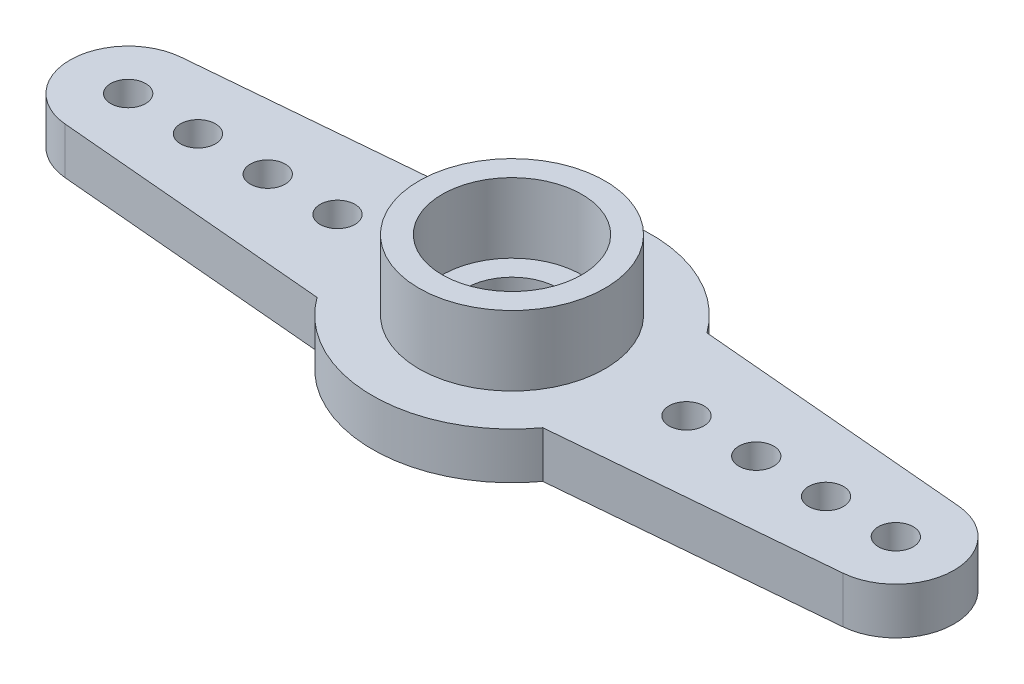
ISO-10303-21;
HEADER;
FILE_DESCRIPTION(('STEP AP214'),'2;1');
FILE_NAME('part.step','',(''),(''),'','','');
FILE_SCHEMA(('AUTOMOTIVE_DESIGN { 1 0 10303 214 1 1 1 1 }'));
ENDSEC;
DATA;
#1=APPLICATION_CONTEXT('core data for automotive mechanical design processes');
#2=APPLICATION_PROTOCOL_DEFINITION('international standard','automotive_design',2000,#1);
#3=PRODUCT_CONTEXT('',#1,'mechanical');
#4=PRODUCT('Part','Part','',(#3));
#5=PRODUCT_RELATED_PRODUCT_CATEGORY('part','',(#4));
#6=PRODUCT_DEFINITION_FORMATION('','',#4);
#7=PRODUCT_DEFINITION_CONTEXT('part definition',#1,'design');
#8=PRODUCT_DEFINITION('design','',#6,#7);
#9=PRODUCT_DEFINITION_SHAPE('','',#8);
#10=(LENGTH_UNIT() NAMED_UNIT(*) SI_UNIT(.MILLI.,.METRE.));
#11=(NAMED_UNIT(*) PLANE_ANGLE_UNIT() SI_UNIT($,.RADIAN.));
#12=(NAMED_UNIT(*) SI_UNIT($,.STERADIAN.) SOLID_ANGLE_UNIT());
#13=UNCERTAINTY_MEASURE_WITH_UNIT(LENGTH_MEASURE(1.E-05),#10,'distance_accuracy_value','');
#14=(GEOMETRIC_REPRESENTATION_CONTEXT(3) GLOBAL_UNCERTAINTY_ASSIGNED_CONTEXT((#13)) GLOBAL_UNIT_ASSIGNED_CONTEXT((#10,
#11,#12)) REPRESENTATION_CONTEXT('',''));
#15=CARTESIAN_POINT('',(0.,0.,0.));
#16=DIRECTION('',(0.,0.,1.));
#17=DIRECTION('',(1.,0.,0.));
#18=AXIS2_PLACEMENT_3D('',#15,#16,#17);
#19=CARTESIAN_POINT('',(16.5,2.,0.));
#20=DIRECTION('',(0.,1.,0.));
#21=DIRECTION('',(0.,0.,1.));
#22=AXIS2_PLACEMENT_3D('',#19,#20,#21);
#23=PLANE('',#22);
#24=CARTESIAN_POINT('',(0.,2.,0.));
#25=DIRECTION('',(0.,1.,0.));
#26=DIRECTION('',(0.,0.,1.));
#27=AXIS2_PLACEMENT_3D('',#24,#25,#26);
#28=CIRCLE('',#27,2.);
#29=CARTESIAN_POINT('',(0.,2.,2.));
#30=VERTEX_POINT('',#29);
#31=EDGE_CURVE('E147',#30,#30,#28,.T.);
#32=ORIENTED_EDGE('',*,*,#31,.F.);
#33=EDGE_LOOP('',(#32));
#34=FACE_BOUND('',#33,.T.);
#35=CARTESIAN_POINT('',(0.,2.,0.));
#36=DIRECTION('',(0.,1.,0.));
#37=DIRECTION('',(0.,0.,1.));
#38=AXIS2_PLACEMENT_3D('',#35,#36,#37);
#39=CIRCLE('',#38,3.);
#40=CARTESIAN_POINT('',(0.,2.,3.));
#41=VERTEX_POINT('',#40);
#42=EDGE_CURVE('E11',#41,#41,#39,.F.);
#43=ORIENTED_EDGE('',*,*,#42,.F.);
#44=EDGE_LOOP('',(#43));
#45=FACE_BOUND('',#44,.T.);
#46=ADVANCED_FACE('F38',(#34,#45),#23,.T.);
#47=CARTESIAN_POINT('',(0.,2.,0.));
#48=DIRECTION('',(0.,1.,0.));
#49=DIRECTION('',(0.,0.,1.));
#50=AXIS2_PLACEMENT_3D('',#47,#48,#49);
#51=CIRCLE('',#50,4.);
#52=CARTESIAN_POINT('',(0.,2.,4.));
#53=VERTEX_POINT('',#52);
#54=EDGE_CURVE('E287',#53,#53,#51,.T.);
#55=ORIENTED_EDGE('',*,*,#54,.F.);
#56=EDGE_LOOP('',(#55));
#57=FACE_BOUND('',#56,.T.);
#58=CARTESIAN_POINT('',(-10.5,2.,0.));
#59=DIRECTION('',(0.,1.,0.));
#60=DIRECTION('',(0.,0.,-1.));
#61=AXIS2_PLACEMENT_3D('',#58,#59,#60);
#62=CIRCLE('',#61,0.75);
#63=CARTESIAN_POINT('',(-10.5,2.,-0.75));
#64=VERTEX_POINT('',#63);
#65=EDGE_CURVE('E267',#64,#64,#62,.T.);
#66=ORIENTED_EDGE('',*,*,#65,.F.);
#67=EDGE_LOOP('',(#66));
#68=FACE_BOUND('',#67,.T.);
#69=CARTESIAN_POINT('',(-16.5,2.,0.));
#70=DIRECTION('',(0.,1.,0.));
#71=DIRECTION('',(0.,0.,-1.));
#72=AXIS2_PLACEMENT_3D('',#69,#70,#71);
#73=CIRCLE('',#72,0.750000000000002);
#74=CARTESIAN_POINT('',(-16.5,2.,-0.750000000000002));
#75=VERTEX_POINT('',#74);
#76=EDGE_CURVE('E251',#75,#75,#73,.T.);
#77=ORIENTED_EDGE('',*,*,#76,.F.);
#78=EDGE_LOOP('',(#77));
#79=FACE_BOUND('',#78,.T.);
#80=CARTESIAN_POINT('',(13.5,2.,0.));
#81=DIRECTION('',(0.,1.,0.));
#82=DIRECTION('',(0.,0.,1.));
#83=AXIS2_PLACEMENT_3D('',#80,#81,#82);
#84=CIRCLE('',#83,0.750000000000002);
#85=CARTESIAN_POINT('',(13.5,2.,0.750000000000002));
#86=VERTEX_POINT('',#85);
#87=EDGE_CURVE('E235',#86,#86,#84,.T.);
#88=ORIENTED_EDGE('',*,*,#87,.F.);
#89=EDGE_LOOP('',(#88));
#90=FACE_BOUND('',#89,.T.);
#91=CARTESIAN_POINT('',(7.5,2.,0.));
#92=DIRECTION('',(0.,1.,0.));
#93=DIRECTION('',(0.,0.,1.));
#94=AXIS2_PLACEMENT_3D('',#91,#92,#93);
#95=CIRCLE('',#94,0.75);
#96=CARTESIAN_POINT('',(7.5,2.,0.75));
#97=VERTEX_POINT('',#96);
#98=EDGE_CURVE('E219',#97,#97,#95,.T.);
#99=ORIENTED_EDGE('',*,*,#98,.F.);
#100=EDGE_LOOP('',(#99));
#101=FACE_BOUND('',#100,.T.);
#102=CARTESIAN_POINT('',(16.5,2.,0.));
#103=DIRECTION('',(0.,1.,0.));
#104=DIRECTION('',(0.,0.,1.));
#105=AXIS2_PLACEMENT_3D('',#102,#103,#104);
#106=CIRCLE('',#105,2.5);
#107=CARTESIAN_POINT('',(16.7178893568691,2.,2.49048674522937));
#108=VERTEX_POINT('',#107);
#109=CARTESIAN_POINT('',(16.7178893568691,2.,-2.49048674522936));
#110=VERTEX_POINT('',#109);
#111=EDGE_CURVE('E165',#108,#110,#106,.T.);
#112=ORIENTED_EDGE('',*,*,#111,.T.);
#113=DIRECTION('',(-0.996194698091746,0.,-0.0871557427476513));
#114=VECTOR('',#113,1.);
#115=CARTESIAN_POINT('',(16.7178893568691,2.,-2.49048674522936));
#116=LINE('',#115,#114);
#117=CARTESIAN_POINT('',(4.85276526325977,2.,-3.5285505947484));
#118=VERTEX_POINT('',#117);
#119=EDGE_CURVE('E100',#110,#118,#116,.T.);
#120=ORIENTED_EDGE('',*,*,#119,.T.);
#121=CARTESIAN_POINT('',(0.,2.,0.));
#122=DIRECTION('',(0.,1.,0.));
#123=DIRECTION('',(0.,0.,1.));
#124=AXIS2_PLACEMENT_3D('',#121,#122,#123);
#125=CIRCLE('',#124,6.);
#126=CARTESIAN_POINT('',(-4.85276526325977,2.,-3.5285505947484));
#127=VERTEX_POINT('',#126);
#128=EDGE_CURVE('E205',#118,#127,#125,.T.);
#129=ORIENTED_EDGE('',*,*,#128,.T.);
#130=DIRECTION('',(-0.996194698091746,0.,0.0871557427476513));
#131=VECTOR('',#130,1.);
#132=CARTESIAN_POINT('',(-16.7178893568691,2.,-2.49048674522936));
#133=LINE('',#132,#131);
#134=CARTESIAN_POINT('',(-16.7178893568691,2.,-2.49048674522936));
#135=VERTEX_POINT('',#134);
#136=EDGE_CURVE('E203',#127,#135,#133,.T.);
#137=ORIENTED_EDGE('',*,*,#136,.T.);
#138=CARTESIAN_POINT('',(-16.5,2.,0.));
#139=DIRECTION('',(0.,1.,0.));
#140=DIRECTION('',(0.,0.,-1.));
#141=AXIS2_PLACEMENT_3D('',#138,#139,#140);
#142=CIRCLE('',#141,2.5);
#143=CARTESIAN_POINT('',(-16.7178893568691,2.,2.49048674522937));
#144=VERTEX_POINT('',#143);
#145=EDGE_CURVE('E120',#135,#144,#142,.T.);
#146=ORIENTED_EDGE('',*,*,#145,.T.);
#147=DIRECTION('',(0.996194698091746,0.,0.0871557427476516));
#148=VECTOR('',#147,1.);
#149=CARTESIAN_POINT('',(-16.7178893568691,2.,2.49048674522937));
#150=LINE('',#149,#148);
#151=CARTESIAN_POINT('',(-4.85276526325977,2.,3.52855059474841));
#152=VERTEX_POINT('',#151);
#153=EDGE_CURVE('E113',#144,#152,#150,.T.);
#154=ORIENTED_EDGE('',*,*,#153,.T.);
#155=CARTESIAN_POINT('',(0.,2.,0.));
#156=DIRECTION('',(0.,1.,0.));
#157=DIRECTION('',(0.,0.,1.));
#158=AXIS2_PLACEMENT_3D('',#155,#156,#157);
#159=CIRCLE('',#158,6.);
#160=CARTESIAN_POINT('',(4.85276526325977,2.,3.52855059474841));
#161=VERTEX_POINT('',#160);
#162=EDGE_CURVE('E118',#152,#161,#159,.T.);
#163=ORIENTED_EDGE('',*,*,#162,.T.);
#164=DIRECTION('',(0.996194698091746,0.,-0.0871557427476516));
#165=VECTOR('',#164,1.);
#166=CARTESIAN_POINT('',(16.7178893568691,2.,2.49048674522937));
#167=LINE('',#166,#165);
#168=EDGE_CURVE('E56',#161,#108,#167,.T.);
#169=ORIENTED_EDGE('',*,*,#168,.T.);
#170=EDGE_LOOP('',(#112,#120,#129,#137,#146,#154,#163,#169));
#171=FACE_BOUND('',#170,.T.);
#172=CARTESIAN_POINT('',(10.5,2.,0.));
#173=DIRECTION('',(0.,1.,0.));
#174=DIRECTION('',(0.,0.,1.));
#175=AXIS2_PLACEMENT_3D('',#172,#173,#174);
#176=CIRCLE('',#175,0.75);
#177=CARTESIAN_POINT('',(10.5,2.,0.75));
#178=VERTEX_POINT('',#177);
#179=EDGE_CURVE('E227',#178,#178,#176,.T.);
#180=ORIENTED_EDGE('',*,*,#179,.F.);
#181=EDGE_LOOP('',(#180));
#182=FACE_BOUND('',#181,.T.);
#183=CARTESIAN_POINT('',(16.5,2.,0.));
#184=DIRECTION('',(0.,1.,0.));
#185=DIRECTION('',(0.,0.,1.));
#186=AXIS2_PLACEMENT_3D('',#183,#184,#185);
#187=CIRCLE('',#186,0.750000000000002);
#188=CARTESIAN_POINT('',(16.5,2.,0.750000000000002));
#189=VERTEX_POINT('',#188);
#190=EDGE_CURVE('E243',#189,#189,#187,.T.);
#191=ORIENTED_EDGE('',*,*,#190,.F.);
#192=EDGE_LOOP('',(#191));
#193=FACE_BOUND('',#192,.T.);
#194=CARTESIAN_POINT('',(-13.5,2.,0.));
#195=DIRECTION('',(0.,1.,0.));
#196=DIRECTION('',(0.,0.,-1.));
#197=AXIS2_PLACEMENT_3D('',#194,#195,#196);
#198=CIRCLE('',#197,0.750000000000002);
#199=CARTESIAN_POINT('',(-13.5,2.,-0.750000000000002));
#200=VERTEX_POINT('',#199);
#201=EDGE_CURVE('E259',#200,#200,#198,.T.);
#202=ORIENTED_EDGE('',*,*,#201,.F.);
#203=EDGE_LOOP('',(#202));
#204=FACE_BOUND('',#203,.T.);
#205=CARTESIAN_POINT('',(-7.5,2.,0.));
#206=DIRECTION('',(0.,1.,0.));
#207=DIRECTION('',(0.,0.,-1.));
#208=AXIS2_PLACEMENT_3D('',#205,#206,#207);
#209=CIRCLE('',#208,0.75);
#210=CARTESIAN_POINT('',(-7.5,2.,-0.75));
#211=VERTEX_POINT('',#210);
#212=EDGE_CURVE('E275',#211,#211,#209,.T.);
#213=ORIENTED_EDGE('',*,*,#212,.F.);
#214=EDGE_LOOP('',(#213));
#215=FACE_BOUND('',#214,.T.);
#216=ADVANCED_FACE('F115',(#57,#68,#79,#90,#101,#171,#182,#193,#204,#215),#23,.T.);
#217=CARTESIAN_POINT('',(16.5,0.,0.));
#218=DIRECTION('',(0.,1.,0.));
#219=DIRECTION('',(0.,0.,1.));
#220=AXIS2_PLACEMENT_3D('',#217,#218,#219);
#221=PLANE('',#220);
#222=CARTESIAN_POINT('',(16.5,0.,0.));
#223=DIRECTION('',(0.,1.,0.));
#224=DIRECTION('',(0.,0.,1.));
#225=AXIS2_PLACEMENT_3D('',#222,#223,#224);
#226=CIRCLE('',#225,2.5);
#227=CARTESIAN_POINT('',(16.7178893568691,0.,2.49048674522937));
#228=VERTEX_POINT('',#227);
#229=CARTESIAN_POINT('',(16.7178893568691,0.,-2.49048674522936));
#230=VERTEX_POINT('',#229);
#231=EDGE_CURVE('E142',#228,#230,#226,.T.);
#232=ORIENTED_EDGE('',*,*,#231,.F.);
#233=DIRECTION('',(0.996194698091746,0.,-0.0871557427476516));
#234=VECTOR('',#233,1.);
#235=CARTESIAN_POINT('',(16.7178893568691,0.,2.49048674522937));
#236=LINE('',#235,#234);
#237=CARTESIAN_POINT('',(4.85276526325977,0.,3.52855059474841));
#238=VERTEX_POINT('',#237);
#239=EDGE_CURVE('E91',#238,#228,#236,.T.);
#240=ORIENTED_EDGE('',*,*,#239,.F.);
#241=CARTESIAN_POINT('',(0.,0.,0.));
#242=DIRECTION('',(0.,1.,0.));
#243=DIRECTION('',(0.,0.,1.));
#244=AXIS2_PLACEMENT_3D('',#241,#242,#243);
#245=CIRCLE('',#244,6.);
#246=CARTESIAN_POINT('',(-4.85276526325977,0.,3.52855059474841));
#247=VERTEX_POINT('',#246);
#248=EDGE_CURVE('E85',#247,#238,#245,.T.);
#249=ORIENTED_EDGE('',*,*,#248,.F.);
#250=DIRECTION('',(0.996194698091746,0.,0.0871557427476516));
#251=VECTOR('',#250,1.);
#252=CARTESIAN_POINT('',(-16.7178893568691,0.,2.49048674522937));
#253=LINE('',#252,#251);
#254=CARTESIAN_POINT('',(-16.7178893568691,0.,2.49048674522937));
#255=VERTEX_POINT('',#254);
#256=EDGE_CURVE('E129',#255,#247,#253,.T.);
#257=ORIENTED_EDGE('',*,*,#256,.F.);
#258=CARTESIAN_POINT('',(-16.5,0.,0.));
#259=DIRECTION('',(0.,1.,0.));
#260=DIRECTION('',(0.,0.,-1.));
#261=AXIS2_PLACEMENT_3D('',#258,#259,#260);
#262=CIRCLE('',#261,2.5);
#263=CARTESIAN_POINT('',(-16.7178893568691,0.,-2.49048674522936));
#264=VERTEX_POINT('',#263);
#265=EDGE_CURVE('E156',#264,#255,#262,.T.);
#266=ORIENTED_EDGE('',*,*,#265,.F.);
#267=DIRECTION('',(-0.996194698091746,0.,0.0871557427476513));
#268=VECTOR('',#267,1.);
#269=CARTESIAN_POINT('',(-16.7178893568691,0.,-2.49048674522936));
#270=LINE('',#269,#268);
#271=CARTESIAN_POINT('',(-4.85276526325977,0.,-3.5285505947484));
#272=VERTEX_POINT('',#271);
#273=EDGE_CURVE('E153',#272,#264,#270,.T.);
#274=ORIENTED_EDGE('',*,*,#273,.F.);
#275=CARTESIAN_POINT('',(0.,0.,0.));
#276=DIRECTION('',(0.,1.,0.));
#277=DIRECTION('',(0.,0.,1.));
#278=AXIS2_PLACEMENT_3D('',#275,#276,#277);
#279=CIRCLE('',#278,6.);
#280=CARTESIAN_POINT('',(4.85276526325977,0.,-3.5285505947484));
#281=VERTEX_POINT('',#280);
#282=EDGE_CURVE('E150',#281,#272,#279,.T.);
#283=ORIENTED_EDGE('',*,*,#282,.F.);
#284=DIRECTION('',(-0.996194698091746,0.,-0.0871557427476513));
#285=VECTOR('',#284,1.);
#286=CARTESIAN_POINT('',(16.7178893568691,0.,-2.49048674522936));
#287=LINE('',#286,#285);
#288=EDGE_CURVE('E146',#230,#281,#287,.T.);
#289=ORIENTED_EDGE('',*,*,#288,.F.);
#290=EDGE_LOOP('',(#232,#240,#249,#257,#266,#274,#283,#289));
#291=FACE_BOUND('',#290,.T.);
#292=CARTESIAN_POINT('',(0.,0.,0.));
#293=DIRECTION('',(0.,1.,0.));
#294=DIRECTION('',(0.,0.,1.));
#295=AXIS2_PLACEMENT_3D('',#292,#293,#294);
#296=CIRCLE('',#295,2.);
#297=CARTESIAN_POINT('',(0.,0.,2.));
#298=VERTEX_POINT('',#297);
#299=EDGE_CURVE('E215',#298,#298,#296,.T.);
#300=ORIENTED_EDGE('',*,*,#299,.T.);
#301=EDGE_LOOP('',(#300));
#302=FACE_BOUND('',#301,.T.);
#303=CARTESIAN_POINT('',(7.5,0.,0.));
#304=DIRECTION('',(0.,1.,0.));
#305=DIRECTION('',(0.,0.,1.));
#306=AXIS2_PLACEMENT_3D('',#303,#304,#305);
#307=CIRCLE('',#306,0.75);
#308=CARTESIAN_POINT('',(7.5,0.,0.75));
#309=VERTEX_POINT('',#308);
#310=EDGE_CURVE('E223',#309,#309,#307,.T.);
#311=ORIENTED_EDGE('',*,*,#310,.T.);
#312=EDGE_LOOP('',(#311));
#313=FACE_BOUND('',#312,.T.);
#314=CARTESIAN_POINT('',(10.5,0.,0.));
#315=DIRECTION('',(0.,1.,0.));
#316=DIRECTION('',(0.,0.,1.));
#317=AXIS2_PLACEMENT_3D('',#314,#315,#316);
#318=CIRCLE('',#317,0.75);
#319=CARTESIAN_POINT('',(10.5,0.,0.75));
#320=VERTEX_POINT('',#319);
#321=EDGE_CURVE('E231',#320,#320,#318,.T.);
#322=ORIENTED_EDGE('',*,*,#321,.T.);
#323=EDGE_LOOP('',(#322));
#324=FACE_BOUND('',#323,.T.);
#325=CARTESIAN_POINT('',(13.5,0.,0.));
#326=DIRECTION('',(0.,1.,0.));
#327=DIRECTION('',(0.,0.,1.));
#328=AXIS2_PLACEMENT_3D('',#325,#326,#327);
#329=CIRCLE('',#328,0.750000000000002);
#330=CARTESIAN_POINT('',(13.5,0.,0.750000000000002));
#331=VERTEX_POINT('',#330);
#332=EDGE_CURVE('E239',#331,#331,#329,.T.);
#333=ORIENTED_EDGE('',*,*,#332,.T.);
#334=EDGE_LOOP('',(#333));
#335=FACE_BOUND('',#334,.T.);
#336=CARTESIAN_POINT('',(16.5,0.,0.));
#337=DIRECTION('',(0.,1.,0.));
#338=DIRECTION('',(0.,0.,1.));
#339=AXIS2_PLACEMENT_3D('',#336,#337,#338);
#340=CIRCLE('',#339,0.750000000000002);
#341=CARTESIAN_POINT('',(16.5,0.,0.750000000000002));
#342=VERTEX_POINT('',#341);
#343=EDGE_CURVE('E247',#342,#342,#340,.T.);
#344=ORIENTED_EDGE('',*,*,#343,.T.);
#345=EDGE_LOOP('',(#344));
#346=FACE_BOUND('',#345,.T.);
#347=CARTESIAN_POINT('',(-16.5,0.,0.));
#348=DIRECTION('',(0.,1.,0.));
#349=DIRECTION('',(0.,0.,-1.));
#350=AXIS2_PLACEMENT_3D('',#347,#348,#349);
#351=CIRCLE('',#350,0.750000000000002);
#352=CARTESIAN_POINT('',(-16.5,0.,-0.750000000000002));
#353=VERTEX_POINT('',#352);
#354=EDGE_CURVE('E255',#353,#353,#351,.T.);
#355=ORIENTED_EDGE('',*,*,#354,.T.);
#356=EDGE_LOOP('',(#355));
#357=FACE_BOUND('',#356,.T.);
#358=CARTESIAN_POINT('',(-13.5,0.,0.));
#359=DIRECTION('',(0.,1.,0.));
#360=DIRECTION('',(0.,0.,-1.));
#361=AXIS2_PLACEMENT_3D('',#358,#359,#360);
#362=CIRCLE('',#361,0.750000000000002);
#363=CARTESIAN_POINT('',(-13.5,0.,-0.750000000000002));
#364=VERTEX_POINT('',#363);
#365=EDGE_CURVE('E263',#364,#364,#362,.T.);
#366=ORIENTED_EDGE('',*,*,#365,.T.);
#367=EDGE_LOOP('',(#366));
#368=FACE_BOUND('',#367,.T.);
#369=CARTESIAN_POINT('',(-10.5,0.,0.));
#370=DIRECTION('',(0.,1.,0.));
#371=DIRECTION('',(0.,0.,-1.));
#372=AXIS2_PLACEMENT_3D('',#369,#370,#371);
#373=CIRCLE('',#372,0.75);
#374=CARTESIAN_POINT('',(-10.5,0.,-0.75));
#375=VERTEX_POINT('',#374);
#376=EDGE_CURVE('E271',#375,#375,#373,.T.);
#377=ORIENTED_EDGE('',*,*,#376,.T.);
#378=EDGE_LOOP('',(#377));
#379=FACE_BOUND('',#378,.T.);
#380=CARTESIAN_POINT('',(-7.5,0.,0.));
#381=DIRECTION('',(0.,1.,0.));
#382=DIRECTION('',(0.,0.,-1.));
#383=AXIS2_PLACEMENT_3D('',#380,#381,#382);
#384=CIRCLE('',#383,0.75);
#385=CARTESIAN_POINT('',(-7.5,0.,-0.75));
#386=VERTEX_POINT('',#385);
#387=EDGE_CURVE('E279',#386,#386,#384,.T.);
#388=ORIENTED_EDGE('',*,*,#387,.T.);
#389=EDGE_LOOP('',(#388));
#390=FACE_BOUND('',#389,.T.);
#391=ADVANCED_FACE('F190',(#291,#302,#313,#324,#335,#346,#357,#368,#379,#390),#221,.F.);
#392=CARTESIAN_POINT('',(16.5,2.,0.));
#393=DIRECTION('',(0.,-1.,0.));
#394=DIRECTION('',(0.,0.,-1.));
#395=AXIS2_PLACEMENT_3D('',#392,#393,#394);
#396=CYLINDRICAL_SURFACE('',#395,2.5);
#397=ORIENTED_EDGE('',*,*,#231,.T.);
#398=DIRECTION('',(0.,-1.,0.));
#399=VECTOR('',#398,1.);
#400=CARTESIAN_POINT('',(16.7178893568691,2.,-2.49048674522936));
#401=LINE('',#400,#399);
#402=EDGE_CURVE('E48',#110,#230,#401,.T.);
#403=ORIENTED_EDGE('',*,*,#402,.F.);
#404=ORIENTED_EDGE('',*,*,#111,.F.);
#405=DIRECTION('',(0.,-1.,0.));
#406=VECTOR('',#405,1.);
#407=CARTESIAN_POINT('',(16.7178893568691,2.,2.49048674522937));
#408=LINE('',#407,#406);
#409=EDGE_CURVE('E138',#108,#228,#408,.T.);
#410=ORIENTED_EDGE('',*,*,#409,.T.);
#411=EDGE_LOOP('',(#397,#403,#404,#410));
#412=FACE_BOUND('',#411,.T.);
#413=ADVANCED_FACE('F40',(#412),#396,.T.);
#414=CARTESIAN_POINT('',(16.7178893568691,2.,-2.49048674522936));
#415=DIRECTION('',(-0.0871557427476513,0.,0.996194698091746));
#416=DIRECTION('',(0.996194698091746,0.,0.0871557427476513));
#417=AXIS2_PLACEMENT_3D('',#414,#415,#416);
#418=PLANE('',#417);
#419=ORIENTED_EDGE('',*,*,#288,.T.);
#420=DIRECTION('',(0.,-1.,0.));
#421=VECTOR('',#420,1.);
#422=CARTESIAN_POINT('',(4.85276526325977,2.,-3.5285505947484));
#423=LINE('',#422,#421);
#424=EDGE_CURVE('E180',#118,#281,#423,.T.);
#425=ORIENTED_EDGE('',*,*,#424,.F.);
#426=ORIENTED_EDGE('',*,*,#119,.F.);
#427=ORIENTED_EDGE('',*,*,#402,.T.);
#428=EDGE_LOOP('',(#419,#425,#426,#427));
#429=FACE_BOUND('',#428,.T.);
#430=ADVANCED_FACE('F185',(#429),#418,.F.);
#431=CARTESIAN_POINT('',(0.,2.,0.));
#432=DIRECTION('',(0.,-1.,0.));
#433=DIRECTION('',(0.,0.,-1.));
#434=AXIS2_PLACEMENT_3D('',#431,#432,#433);
#435=CYLINDRICAL_SURFACE('',#434,6.);
#436=ORIENTED_EDGE('',*,*,#282,.T.);
#437=DIRECTION('',(0.,-1.,0.));
#438=VECTOR('',#437,1.);
#439=CARTESIAN_POINT('',(-4.85276526325977,2.,-3.5285505947484));
#440=LINE('',#439,#438);
#441=EDGE_CURVE('E176',#127,#272,#440,.T.);
#442=ORIENTED_EDGE('',*,*,#441,.F.);
#443=ORIENTED_EDGE('',*,*,#128,.F.);
#444=ORIENTED_EDGE('',*,*,#424,.T.);
#445=EDGE_LOOP('',(#436,#442,#443,#444));
#446=FACE_BOUND('',#445,.T.);
#447=ADVANCED_FACE('F197',(#446),#435,.T.);
#448=CARTESIAN_POINT('',(-16.7178893568691,2.,-2.49048674522936));
#449=DIRECTION('',(0.0871557427476513,0.,0.996194698091746));
#450=DIRECTION('',(0.996194698091746,0.,-0.0871557427476513));
#451=AXIS2_PLACEMENT_3D('',#448,#449,#450);
#452=PLANE('',#451);
#453=ORIENTED_EDGE('',*,*,#273,.T.);
#454=DIRECTION('',(0.,-1.,0.));
#455=VECTOR('',#454,1.);
#456=CARTESIAN_POINT('',(-16.7178893568691,2.,-2.49048674522936));
#457=LINE('',#456,#455);
#458=EDGE_CURVE('E172',#135,#264,#457,.T.);
#459=ORIENTED_EDGE('',*,*,#458,.F.);
#460=ORIENTED_EDGE('',*,*,#136,.F.);
#461=ORIENTED_EDGE('',*,*,#441,.T.);
#462=EDGE_LOOP('',(#453,#459,#460,#461));
#463=FACE_BOUND('',#462,.T.);
#464=ADVANCED_FACE('F201',(#463),#452,.F.);
#465=CARTESIAN_POINT('',(-16.5,2.,0.));
#466=DIRECTION('',(0.,-1.,0.));
#467=DIRECTION('',(0.,0.,-1.));
#468=AXIS2_PLACEMENT_3D('',#465,#466,#467);
#469=CYLINDRICAL_SURFACE('',#468,2.5);
#470=ORIENTED_EDGE('',*,*,#265,.T.);
#471=DIRECTION('',(0.,-1.,0.));
#472=VECTOR('',#471,1.);
#473=CARTESIAN_POINT('',(-16.7178893568691,2.,2.49048674522937));
#474=LINE('',#473,#472);
#475=EDGE_CURVE('E131',#144,#255,#474,.T.);
#476=ORIENTED_EDGE('',*,*,#475,.F.);
#477=ORIENTED_EDGE('',*,*,#145,.F.);
#478=ORIENTED_EDGE('',*,*,#458,.T.);
#479=EDGE_LOOP('',(#470,#476,#477,#478));
#480=FACE_BOUND('',#479,.T.);
#481=ADVANCED_FACE('F340',(#480),#469,.T.);
#482=CARTESIAN_POINT('',(-16.7178893568691,2.,2.49048674522937));
#483=DIRECTION('',(0.0871557427476516,0.,-0.996194698091746));
#484=DIRECTION('',(-0.996194698091746,0.,-0.0871557427476516));
#485=AXIS2_PLACEMENT_3D('',#482,#483,#484);
#486=PLANE('',#485);
#487=ORIENTED_EDGE('',*,*,#256,.T.);
#488=DIRECTION('',(0.,-1.,0.));
#489=VECTOR('',#488,1.);
#490=CARTESIAN_POINT('',(-4.85276526325977,2.,3.52855059474841));
#491=LINE('',#490,#489);
#492=EDGE_CURVE('E126',#152,#247,#491,.T.);
#493=ORIENTED_EDGE('',*,*,#492,.F.);
#494=ORIENTED_EDGE('',*,*,#153,.F.);
#495=ORIENTED_EDGE('',*,*,#475,.T.);
#496=EDGE_LOOP('',(#487,#493,#494,#495));
#497=FACE_BOUND('',#496,.T.);
#498=ADVANCED_FACE('F127',(#497),#486,.F.);
#499=CARTESIAN_POINT('',(0.,2.,0.));
#500=DIRECTION('',(0.,-1.,0.));
#501=DIRECTION('',(0.,0.,-1.));
#502=AXIS2_PLACEMENT_3D('',#499,#500,#501);
#503=CYLINDRICAL_SURFACE('',#502,6.);
#504=ORIENTED_EDGE('',*,*,#248,.T.);
#505=DIRECTION('',(0.,-1.,0.));
#506=VECTOR('',#505,1.);
#507=CARTESIAN_POINT('',(4.85276526325977,2.,3.52855059474841));
#508=LINE('',#507,#506);
#509=EDGE_CURVE('E132',#161,#238,#508,.T.);
#510=ORIENTED_EDGE('',*,*,#509,.F.);
#511=ORIENTED_EDGE('',*,*,#162,.F.);
#512=ORIENTED_EDGE('',*,*,#492,.T.);
#513=EDGE_LOOP('',(#504,#510,#511,#512));
#514=FACE_BOUND('',#513,.T.);
#515=ADVANCED_FACE('F134',(#514),#503,.T.);
#516=CARTESIAN_POINT('',(16.7178893568691,2.,2.49048674522937));
#517=DIRECTION('',(-0.0871557427476516,0.,-0.996194698091746));
#518=DIRECTION('',(-0.996194698091746,0.,0.0871557427476516));
#519=AXIS2_PLACEMENT_3D('',#516,#517,#518);
#520=PLANE('',#519);
#521=ORIENTED_EDGE('',*,*,#239,.T.);
#522=ORIENTED_EDGE('',*,*,#409,.F.);
#523=ORIENTED_EDGE('',*,*,#168,.F.);
#524=ORIENTED_EDGE('',*,*,#509,.T.);
#525=EDGE_LOOP('',(#521,#522,#523,#524));
#526=FACE_BOUND('',#525,.T.);
#527=ADVANCED_FACE('F333',(#526),#520,.F.);
#528=CARTESIAN_POINT('',(0.,2.,0.));
#529=DIRECTION('',(0.,-1.,0.));
#530=DIRECTION('',(0.,0.,-1.));
#531=AXIS2_PLACEMENT_3D('',#528,#529,#530);
#532=CYLINDRICAL_SURFACE('',#531,2.);
#533=ORIENTED_EDGE('',*,*,#31,.T.);
#534=EDGE_LOOP('',(#533));
#535=FACE_BOUND('',#534,.T.);
#536=ORIENTED_EDGE('',*,*,#299,.F.);
#537=EDGE_LOOP('',(#536));
#538=FACE_BOUND('',#537,.T.);
#539=ADVANCED_FACE('F329',(#535,#538),#532,.F.);
#540=CARTESIAN_POINT('',(7.5,2.,0.));
#541=DIRECTION('',(0.,-1.,0.));
#542=DIRECTION('',(0.,0.,-1.));
#543=AXIS2_PLACEMENT_3D('',#540,#541,#542);
#544=CYLINDRICAL_SURFACE('',#543,0.75);
#545=ORIENTED_EDGE('',*,*,#98,.T.);
#546=EDGE_LOOP('',(#545));
#547=FACE_BOUND('',#546,.T.);
#548=ORIENTED_EDGE('',*,*,#310,.F.);
#549=EDGE_LOOP('',(#548));
#550=FACE_BOUND('',#549,.T.);
#551=ADVANCED_FACE('F442',(#547,#550),#544,.F.);
#552=CARTESIAN_POINT('',(10.5,2.,0.));
#553=DIRECTION('',(0.,-1.,0.));
#554=DIRECTION('',(0.,0.,-1.));
#555=AXIS2_PLACEMENT_3D('',#552,#553,#554);
#556=CYLINDRICAL_SURFACE('',#555,0.75);
#557=ORIENTED_EDGE('',*,*,#179,.T.);
#558=EDGE_LOOP('',(#557));
#559=FACE_BOUND('',#558,.T.);
#560=ORIENTED_EDGE('',*,*,#321,.F.);
#561=EDGE_LOOP('',(#560));
#562=FACE_BOUND('',#561,.T.);
#563=ADVANCED_FACE('F433',(#559,#562),#556,.F.);
#564=CARTESIAN_POINT('',(13.5,2.,0.));
#565=DIRECTION('',(0.,-1.,0.));
#566=DIRECTION('',(0.,0.,-1.));
#567=AXIS2_PLACEMENT_3D('',#564,#565,#566);
#568=CYLINDRICAL_SURFACE('',#567,0.750000000000002);
#569=ORIENTED_EDGE('',*,*,#87,.T.);
#570=EDGE_LOOP('',(#569));
#571=FACE_BOUND('',#570,.T.);
#572=ORIENTED_EDGE('',*,*,#332,.F.);
#573=EDGE_LOOP('',(#572));
#574=FACE_BOUND('',#573,.T.);
#575=ADVANCED_FACE('F424',(#571,#574),#568,.F.);
#576=CARTESIAN_POINT('',(16.5,2.,0.));
#577=DIRECTION('',(0.,-1.,0.));
#578=DIRECTION('',(0.,0.,-1.));
#579=AXIS2_PLACEMENT_3D('',#576,#577,#578);
#580=CYLINDRICAL_SURFACE('',#579,0.750000000000002);
#581=ORIENTED_EDGE('',*,*,#190,.T.);
#582=EDGE_LOOP('',(#581));
#583=FACE_BOUND('',#582,.T.);
#584=ORIENTED_EDGE('',*,*,#343,.F.);
#585=EDGE_LOOP('',(#584));
#586=FACE_BOUND('',#585,.T.);
#587=ADVANCED_FACE('F415',(#583,#586),#580,.F.);
#588=CARTESIAN_POINT('',(-16.5,2.,0.));
#589=DIRECTION('',(0.,-1.,0.));
#590=DIRECTION('',(0.,0.,-1.));
#591=AXIS2_PLACEMENT_3D('',#588,#589,#590);
#592=CYLINDRICAL_SURFACE('',#591,0.750000000000002);
#593=ORIENTED_EDGE('',*,*,#76,.T.);
#594=EDGE_LOOP('',(#593));
#595=FACE_BOUND('',#594,.T.);
#596=ORIENTED_EDGE('',*,*,#354,.F.);
#597=EDGE_LOOP('',(#596));
#598=FACE_BOUND('',#597,.T.);
#599=ADVANCED_FACE('F406',(#595,#598),#592,.F.);
#600=CARTESIAN_POINT('',(-13.5,2.,0.));
#601=DIRECTION('',(0.,-1.,0.));
#602=DIRECTION('',(0.,0.,-1.));
#603=AXIS2_PLACEMENT_3D('',#600,#601,#602);
#604=CYLINDRICAL_SURFACE('',#603,0.750000000000002);
#605=ORIENTED_EDGE('',*,*,#201,.T.);
#606=EDGE_LOOP('',(#605));
#607=FACE_BOUND('',#606,.T.);
#608=ORIENTED_EDGE('',*,*,#365,.F.);
#609=EDGE_LOOP('',(#608));
#610=FACE_BOUND('',#609,.T.);
#611=ADVANCED_FACE('F397',(#607,#610),#604,.F.);
#612=CARTESIAN_POINT('',(-10.5,2.,0.));
#613=DIRECTION('',(0.,-1.,0.));
#614=DIRECTION('',(0.,0.,-1.));
#615=AXIS2_PLACEMENT_3D('',#612,#613,#614);
#616=CYLINDRICAL_SURFACE('',#615,0.75);
#617=ORIENTED_EDGE('',*,*,#65,.T.);
#618=EDGE_LOOP('',(#617));
#619=FACE_BOUND('',#618,.T.);
#620=ORIENTED_EDGE('',*,*,#376,.F.);
#621=EDGE_LOOP('',(#620));
#622=FACE_BOUND('',#621,.T.);
#623=ADVANCED_FACE('F314',(#619,#622),#616,.F.);
#624=CARTESIAN_POINT('',(-7.5,2.,0.));
#625=DIRECTION('',(0.,-1.,0.));
#626=DIRECTION('',(0.,0.,-1.));
#627=AXIS2_PLACEMENT_3D('',#624,#625,#626);
#628=CYLINDRICAL_SURFACE('',#627,0.75);
#629=ORIENTED_EDGE('',*,*,#212,.T.);
#630=EDGE_LOOP('',(#629));
#631=FACE_BOUND('',#630,.T.);
#632=ORIENTED_EDGE('',*,*,#387,.F.);
#633=EDGE_LOOP('',(#632));
#634=FACE_BOUND('',#633,.T.);
#635=ADVANCED_FACE('F305',(#631,#634),#628,.F.);
#636=CARTESIAN_POINT('',(0.,5.,0.));
#637=DIRECTION('',(0.,1.,0.));
#638=DIRECTION('',(0.,0.,1.));
#639=AXIS2_PLACEMENT_3D('',#636,#637,#638);
#640=PLANE('',#639);
#641=CARTESIAN_POINT('',(0.,5.,0.));
#642=DIRECTION('',(0.,1.,0.));
#643=DIRECTION('',(0.,0.,1.));
#644=AXIS2_PLACEMENT_3D('',#641,#642,#643);
#645=CIRCLE('',#644,4.);
#646=CARTESIAN_POINT('',(0.,5.,4.));
#647=VERTEX_POINT('',#646);
#648=EDGE_CURVE('E283',#647,#647,#645,.T.);
#649=ORIENTED_EDGE('',*,*,#648,.T.);
#650=EDGE_LOOP('',(#649));
#651=FACE_BOUND('',#650,.T.);
#652=CARTESIAN_POINT('',(0.,5.,0.));
#653=DIRECTION('',(0.,1.,0.));
#654=DIRECTION('',(0.,0.,1.));
#655=AXIS2_PLACEMENT_3D('',#652,#653,#654);
#656=CIRCLE('',#655,3.);
#657=CARTESIAN_POINT('',(0.,5.,3.));
#658=VERTEX_POINT('',#657);
#659=EDGE_CURVE('E291',#658,#658,#656,.T.);
#660=ORIENTED_EDGE('',*,*,#659,.F.);
#661=EDGE_LOOP('',(#660));
#662=FACE_BOUND('',#661,.T.);
#663=ADVANCED_FACE('F302',(#651,#662),#640,.T.);
#664=CARTESIAN_POINT('',(0.,5.,0.));
#665=DIRECTION('',(0.,-1.,0.));
#666=DIRECTION('',(0.,0.,-1.));
#667=AXIS2_PLACEMENT_3D('',#664,#665,#666);
#668=CYLINDRICAL_SURFACE('',#667,4.);
#669=ORIENTED_EDGE('',*,*,#648,.F.);
#670=EDGE_LOOP('',(#669));
#671=FACE_BOUND('',#670,.T.);
#672=ORIENTED_EDGE('',*,*,#54,.T.);
#673=EDGE_LOOP('',(#672));
#674=FACE_BOUND('',#673,.T.);
#675=ADVANCED_FACE('F304',(#671,#674),#668,.T.);
#676=CARTESIAN_POINT('',(0.,5.,0.));
#677=DIRECTION('',(0.,-1.,0.));
#678=DIRECTION('',(0.,0.,-1.));
#679=AXIS2_PLACEMENT_3D('',#676,#677,#678);
#680=CYLINDRICAL_SURFACE('',#679,3.);
#681=ORIENTED_EDGE('',*,*,#659,.T.);
#682=EDGE_LOOP('',(#681));
#683=FACE_BOUND('',#682,.T.);
#684=ORIENTED_EDGE('',*,*,#42,.T.);
#685=EDGE_LOOP('',(#684));
#686=FACE_BOUND('',#685,.T.);
#687=ADVANCED_FACE('F299',(#683,#686),#680,.F.);
#688=CLOSED_SHELL('',(#46,#216,#391,#413,#430,#447,#464,#481,#498,#515,#527,#539,#551,#563,#575,
#587,#599,#611,#623,#635,#663,#675,#687));
#689=MANIFOLD_SOLID_BREP('B2',#688);
#690=ADVANCED_BREP_SHAPE_REPRESENTATION('',(#18,#689),#14);
#691=SHAPE_DEFINITION_REPRESENTATION(#9,#690);
ENDSEC;
END-ISO-10303-21;
